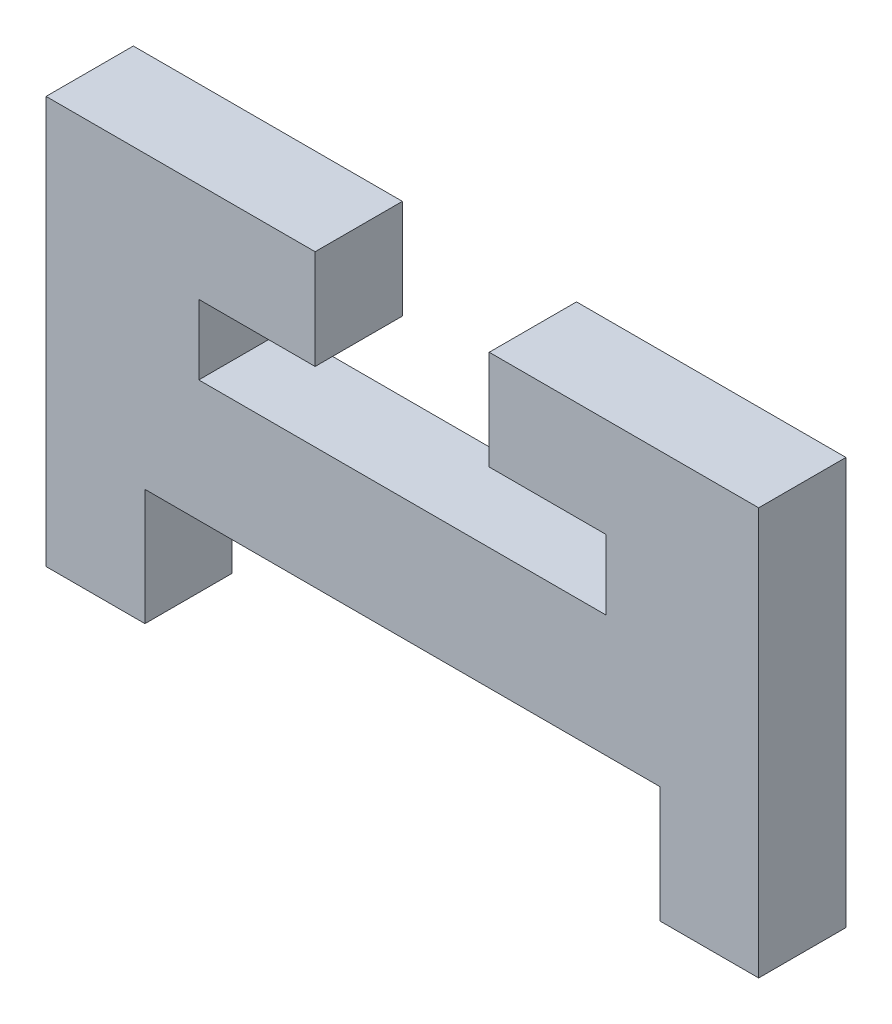
ISO-10303-21;
HEADER;
FILE_DESCRIPTION(('STEP AP214'),'2;1');
FILE_NAME('part.step','',(''),(''),'','','');
FILE_SCHEMA(('AUTOMOTIVE_DESIGN { 1 0 10303 214 1 1 1 1 }'));
ENDSEC;
DATA;
#1=APPLICATION_CONTEXT('core data for automotive mechanical design processes');
#2=APPLICATION_PROTOCOL_DEFINITION('international standard','automotive_design',2000,#1);
#3=PRODUCT_CONTEXT('',#1,'mechanical');
#4=PRODUCT('Part','Part','',(#3));
#5=PRODUCT_RELATED_PRODUCT_CATEGORY('part','',(#4));
#6=PRODUCT_DEFINITION_FORMATION('','',#4);
#7=PRODUCT_DEFINITION_CONTEXT('part definition',#1,'design');
#8=PRODUCT_DEFINITION('design','',#6,#7);
#9=PRODUCT_DEFINITION_SHAPE('','',#8);
#10=(LENGTH_UNIT() NAMED_UNIT(*) SI_UNIT(.MILLI.,.METRE.));
#11=(NAMED_UNIT(*) PLANE_ANGLE_UNIT() SI_UNIT($,.RADIAN.));
#12=(NAMED_UNIT(*) SI_UNIT($,.STERADIAN.) SOLID_ANGLE_UNIT());
#13=UNCERTAINTY_MEASURE_WITH_UNIT(LENGTH_MEASURE(1.E-05),#10,'distance_accuracy_value','');
#14=(GEOMETRIC_REPRESENTATION_CONTEXT(3) GLOBAL_UNCERTAINTY_ASSIGNED_CONTEXT((#13)) GLOBAL_UNIT_ASSIGNED_CONTEXT((#10,
#11,#12)) REPRESENTATION_CONTEXT('',''));
#15=CARTESIAN_POINT('',(0.,0.,0.));
#16=DIRECTION('',(0.,0.,1.));
#17=DIRECTION('',(1.,0.,0.));
#18=AXIS2_PLACEMENT_3D('',#15,#16,#17);
#19=CARTESIAN_POINT('',(38.05,11.7,3.));
#20=DIRECTION('',(1.,0.,0.));
#21=DIRECTION('',(0.,0.,-1.));
#22=AXIS2_PLACEMENT_3D('',#19,#20,#21);
#23=PLANE('',#22);
#24=DIRECTION('',(0.,-1.,0.));
#25=VECTOR('',#24,1.);
#26=CARTESIAN_POINT('',(38.05,11.7,0.));
#27=LINE('',#26,#25);
#28=CARTESIAN_POINT('',(38.05,11.7,0.));
#29=VERTEX_POINT('',#28);
#30=CARTESIAN_POINT('',(38.05,7.70000000000001,0.));
#31=VERTEX_POINT('',#30);
#32=EDGE_CURVE('E177',#29,#31,#27,.T.);
#33=ORIENTED_EDGE('',*,*,#32,.T.);
#34=DIRECTION('',(0.,0.,-1.));
#35=VECTOR('',#34,1.);
#36=CARTESIAN_POINT('',(38.05,7.70000000000001,3.));
#37=LINE('',#36,#35);
#38=CARTESIAN_POINT('',(38.05,7.70000000000001,3.));
#39=VERTEX_POINT('',#38);
#40=EDGE_CURVE('E11',#39,#31,#37,.T.);
#41=ORIENTED_EDGE('',*,*,#40,.F.);
#42=DIRECTION('',(0.,-1.,0.));
#43=VECTOR('',#42,1.);
#44=CARTESIAN_POINT('',(38.05,11.7,3.));
#45=LINE('',#44,#43);
#46=CARTESIAN_POINT('',(38.05,11.7,3.));
#47=VERTEX_POINT('',#46);
#48=EDGE_CURVE('E208',#47,#39,#45,.T.);
#49=ORIENTED_EDGE('',*,*,#48,.F.);
#50=DIRECTION('',(0.,0.,-1.));
#51=VECTOR('',#50,1.);
#52=CARTESIAN_POINT('',(38.05,11.7,3.));
#53=LINE('',#52,#51);
#54=EDGE_CURVE('E173',#47,#29,#53,.T.);
#55=ORIENTED_EDGE('',*,*,#54,.T.);
#56=EDGE_LOOP('',(#33,#41,#49,#55));
#57=FACE_BOUND('',#56,.T.);
#58=ADVANCED_FACE('F33',(#57),#23,.F.);
#59=CARTESIAN_POINT('',(38.05,7.70000000000001,3.));
#60=DIRECTION('',(0.,1.,0.));
#61=DIRECTION('',(0.,0.,1.));
#62=AXIS2_PLACEMENT_3D('',#59,#60,#61);
#63=PLANE('',#62);
#64=DIRECTION('',(1.,0.,0.));
#65=VECTOR('',#64,1.);
#66=CARTESIAN_POINT('',(38.05,7.70000000000001,0.));
#67=LINE('',#66,#65);
#68=CARTESIAN_POINT('',(41.45,7.70000000000001,0.));
#69=VERTEX_POINT('',#68);
#70=EDGE_CURVE('E180',#31,#69,#67,.T.);
#71=ORIENTED_EDGE('',*,*,#70,.T.);
#72=DIRECTION('',(0.,0.,-1.));
#73=VECTOR('',#72,1.);
#74=CARTESIAN_POINT('',(41.45,7.70000000000001,3.));
#75=LINE('',#74,#73);
#76=CARTESIAN_POINT('',(41.45,7.70000000000001,3.));
#77=VERTEX_POINT('',#76);
#78=EDGE_CURVE('E41',#77,#69,#75,.T.);
#79=ORIENTED_EDGE('',*,*,#78,.F.);
#80=DIRECTION('',(1.,0.,0.));
#81=VECTOR('',#80,1.);
#82=CARTESIAN_POINT('',(38.05,7.70000000000001,3.));
#83=LINE('',#82,#81);
#84=EDGE_CURVE('E116',#39,#77,#83,.T.);
#85=ORIENTED_EDGE('',*,*,#84,.F.);
#86=ORIENTED_EDGE('',*,*,#40,.T.);
#87=EDGE_LOOP('',(#71,#79,#85,#86));
#88=FACE_BOUND('',#87,.T.);
#89=ADVANCED_FACE('F306',(#88),#63,.F.);
#90=CARTESIAN_POINT('',(41.45,7.70000000000001,3.));
#91=DIRECTION('',(-1.,0.,0.));
#92=DIRECTION('',(0.,0.,1.));
#93=AXIS2_PLACEMENT_3D('',#90,#91,#92);
#94=PLANE('',#93);
#95=DIRECTION('',(0.,1.,0.));
#96=VECTOR('',#95,1.);
#97=CARTESIAN_POINT('',(41.45,7.70000000000001,0.));
#98=LINE('',#97,#96);
#99=CARTESIAN_POINT('',(41.45,21.7,0.));
#100=VERTEX_POINT('',#99);
#101=EDGE_CURVE('E182',#69,#100,#98,.T.);
#102=ORIENTED_EDGE('',*,*,#101,.T.);
#103=DIRECTION('',(0.,0.,-1.));
#104=VECTOR('',#103,1.);
#105=CARTESIAN_POINT('',(41.45,21.7,3.));
#106=LINE('',#105,#104);
#107=CARTESIAN_POINT('',(41.45,21.7,3.));
#108=VERTEX_POINT('',#107);
#109=EDGE_CURVE('E239',#108,#100,#106,.T.);
#110=ORIENTED_EDGE('',*,*,#109,.F.);
#111=DIRECTION('',(0.,1.,0.));
#112=VECTOR('',#111,1.);
#113=CARTESIAN_POINT('',(41.45,7.70000000000001,3.));
#114=LINE('',#113,#112);
#115=EDGE_CURVE('E247',#77,#108,#114,.T.);
#116=ORIENTED_EDGE('',*,*,#115,.F.);
#117=ORIENTED_EDGE('',*,*,#78,.T.);
#118=EDGE_LOOP('',(#102,#110,#116,#117));
#119=FACE_BOUND('',#118,.T.);
#120=ADVANCED_FACE('F245',(#119),#94,.F.);
#121=CARTESIAN_POINT('',(41.45,21.7,3.));
#122=DIRECTION('',(0.,-1.,0.));
#123=DIRECTION('',(0.,0.,-1.));
#124=AXIS2_PLACEMENT_3D('',#121,#122,#123);
#125=PLANE('',#124);
#126=DIRECTION('',(-1.,0.,0.));
#127=VECTOR('',#126,1.);
#128=CARTESIAN_POINT('',(41.45,21.7,0.));
#129=LINE('',#128,#127);
#130=CARTESIAN_POINT('',(32.1863854020223,21.7,0.));
#131=VERTEX_POINT('',#130);
#132=EDGE_CURVE('E184',#100,#131,#129,.T.);
#133=ORIENTED_EDGE('',*,*,#132,.T.);
#134=DIRECTION('',(0.,0.,-1.));
#135=VECTOR('',#134,1.);
#136=CARTESIAN_POINT('',(32.1863854020223,21.7,3.));
#137=LINE('',#136,#135);
#138=CARTESIAN_POINT('',(32.1863854020223,21.7,3.));
#139=VERTEX_POINT('',#138);
#140=EDGE_CURVE('E236',#139,#131,#137,.T.);
#141=ORIENTED_EDGE('',*,*,#140,.F.);
#142=DIRECTION('',(-1.,0.,0.));
#143=VECTOR('',#142,1.);
#144=CARTESIAN_POINT('',(41.45,21.7,3.));
#145=LINE('',#144,#143);
#146=EDGE_CURVE('E265',#108,#139,#145,.T.);
#147=ORIENTED_EDGE('',*,*,#146,.F.);
#148=ORIENTED_EDGE('',*,*,#109,.T.);
#149=EDGE_LOOP('',(#133,#141,#147,#148));
#150=FACE_BOUND('',#149,.T.);
#151=ADVANCED_FACE('F256',(#150),#125,.F.);
#152=CARTESIAN_POINT('',(32.1863854020223,21.7,3.));
#153=DIRECTION('',(1.,0.,0.));
#154=DIRECTION('',(0.,0.,-1.));
#155=AXIS2_PLACEMENT_3D('',#152,#153,#154);
#156=PLANE('',#155);
#157=DIRECTION('',(0.,-1.,0.));
#158=VECTOR('',#157,1.);
#159=CARTESIAN_POINT('',(32.1863854020223,21.7,0.));
#160=LINE('',#159,#158);
#161=CARTESIAN_POINT('',(32.1863854020223,18.2826832944775,0.));
#162=VERTEX_POINT('',#161);
#163=EDGE_CURVE('E186',#131,#162,#160,.T.);
#164=ORIENTED_EDGE('',*,*,#163,.T.);
#165=DIRECTION('',(0.,0.,-1.));
#166=VECTOR('',#165,1.);
#167=CARTESIAN_POINT('',(32.1863854020223,18.2826832944775,3.));
#168=LINE('',#167,#166);
#169=CARTESIAN_POINT('',(32.1863854020223,18.2826832944775,3.));
#170=VERTEX_POINT('',#169);
#171=EDGE_CURVE('E233',#170,#162,#168,.T.);
#172=ORIENTED_EDGE('',*,*,#171,.F.);
#173=DIRECTION('',(0.,-1.,0.));
#174=VECTOR('',#173,1.);
#175=CARTESIAN_POINT('',(32.1863854020223,21.7,3.));
#176=LINE('',#175,#174);
#177=EDGE_CURVE('E262',#139,#170,#176,.T.);
#178=ORIENTED_EDGE('',*,*,#177,.F.);
#179=ORIENTED_EDGE('',*,*,#140,.T.);
#180=EDGE_LOOP('',(#164,#172,#178,#179));
#181=FACE_BOUND('',#180,.T.);
#182=ADVANCED_FACE('F260',(#181),#156,.F.);
#183=CARTESIAN_POINT('',(32.1863854020223,18.2826832944775,3.));
#184=DIRECTION('',(0.,1.,0.));
#185=DIRECTION('',(0.,0.,1.));
#186=AXIS2_PLACEMENT_3D('',#183,#184,#185);
#187=PLANE('',#186);
#188=DIRECTION('',(1.,0.,0.));
#189=VECTOR('',#188,1.);
#190=CARTESIAN_POINT('',(32.1863854020223,18.2826832944775,0.));
#191=LINE('',#190,#189);
#192=CARTESIAN_POINT('',(36.2,18.2826832944775,0.));
#193=VERTEX_POINT('',#192);
#194=EDGE_CURVE('E188',#162,#193,#191,.T.);
#195=ORIENTED_EDGE('',*,*,#194,.T.);
#196=DIRECTION('',(0.,0.,-1.));
#197=VECTOR('',#196,1.);
#198=CARTESIAN_POINT('',(36.2,18.2826832944775,3.));
#199=LINE('',#198,#197);
#200=CARTESIAN_POINT('',(36.2,18.2826832944775,3.));
#201=VERTEX_POINT('',#200);
#202=EDGE_CURVE('E230',#201,#193,#199,.T.);
#203=ORIENTED_EDGE('',*,*,#202,.F.);
#204=DIRECTION('',(1.,0.,0.));
#205=VECTOR('',#204,1.);
#206=CARTESIAN_POINT('',(32.1863854020223,18.2826832944775,3.));
#207=LINE('',#206,#205);
#208=EDGE_CURVE('E264',#170,#201,#207,.T.);
#209=ORIENTED_EDGE('',*,*,#208,.F.);
#210=ORIENTED_EDGE('',*,*,#171,.T.);
#211=EDGE_LOOP('',(#195,#203,#209,#210));
#212=FACE_BOUND('',#211,.T.);
#213=ADVANCED_FACE('F319',(#212),#187,.F.);
#214=CARTESIAN_POINT('',(36.2,18.2826832944775,3.));
#215=DIRECTION('',(1.,0.,0.));
#216=DIRECTION('',(0.,0.,-1.));
#217=AXIS2_PLACEMENT_3D('',#214,#215,#216);
#218=PLANE('',#217);
#219=DIRECTION('',(0.,-1.,0.));
#220=VECTOR('',#219,1.);
#221=CARTESIAN_POINT('',(36.2,18.2826832944775,0.));
#222=LINE('',#221,#220);
#223=CARTESIAN_POINT('',(36.2,15.8826832944775,0.));
#224=VERTEX_POINT('',#223);
#225=EDGE_CURVE('E190',#193,#224,#222,.T.);
#226=ORIENTED_EDGE('',*,*,#225,.T.);
#227=DIRECTION('',(0.,0.,-1.));
#228=VECTOR('',#227,1.);
#229=CARTESIAN_POINT('',(36.2,15.8826832944775,3.));
#230=LINE('',#229,#228);
#231=CARTESIAN_POINT('',(36.2,15.8826832944775,3.));
#232=VERTEX_POINT('',#231);
#233=EDGE_CURVE('E227',#232,#224,#230,.T.);
#234=ORIENTED_EDGE('',*,*,#233,.F.);
#235=DIRECTION('',(0.,-1.,0.));
#236=VECTOR('',#235,1.);
#237=CARTESIAN_POINT('',(36.2,18.2826832944775,3.));
#238=LINE('',#237,#236);
#239=EDGE_CURVE('E267',#201,#232,#238,.T.);
#240=ORIENTED_EDGE('',*,*,#239,.F.);
#241=ORIENTED_EDGE('',*,*,#202,.T.);
#242=EDGE_LOOP('',(#226,#234,#240,#241));
#243=FACE_BOUND('',#242,.T.);
#244=ADVANCED_FACE('F322',(#243),#218,.F.);
#245=CARTESIAN_POINT('',(29.7,15.8826832944775,3.));
#246=DIRECTION('',(0.,-1.,0.));
#247=DIRECTION('',(0.,0.,-1.));
#248=AXIS2_PLACEMENT_3D('',#245,#246,#247);
#249=PLANE('',#248);
#250=DIRECTION('',(-1.,0.,0.));
#251=VECTOR('',#250,1.);
#252=CARTESIAN_POINT('',(29.7,15.8826832944775,0.));
#253=LINE('',#252,#251);
#254=CARTESIAN_POINT('',(22.2,15.8826832944775,0.));
#255=VERTEX_POINT('',#254);
#256=EDGE_CURVE('E193',#224,#255,#253,.T.);
#257=ORIENTED_EDGE('',*,*,#256,.T.);
#258=DIRECTION('',(0.,0.,-1.));
#259=VECTOR('',#258,1.);
#260=CARTESIAN_POINT('',(22.2,15.8826832944775,3.));
#261=LINE('',#260,#259);
#262=CARTESIAN_POINT('',(22.2,15.8826832944775,3.));
#263=VERTEX_POINT('',#262);
#264=EDGE_CURVE('E224',#263,#255,#261,.T.);
#265=ORIENTED_EDGE('',*,*,#264,.F.);
#266=DIRECTION('',(-1.,0.,0.));
#267=VECTOR('',#266,1.);
#268=CARTESIAN_POINT('',(36.2,15.8826832944775,3.));
#269=LINE('',#268,#267);
#270=EDGE_CURVE('E273',#232,#263,#269,.T.);
#271=ORIENTED_EDGE('',*,*,#270,.F.);
#272=ORIENTED_EDGE('',*,*,#233,.T.);
#273=EDGE_LOOP('',(#257,#265,#271,#272));
#274=FACE_BOUND('',#273,.T.);
#275=ADVANCED_FACE('F326',(#274),#249,.F.);
#276=CARTESIAN_POINT('',(22.2,15.8826832944775,3.));
#277=DIRECTION('',(-1.,0.,0.));
#278=DIRECTION('',(0.,0.,1.));
#279=AXIS2_PLACEMENT_3D('',#276,#277,#278);
#280=PLANE('',#279);
#281=DIRECTION('',(0.,1.,0.));
#282=VECTOR('',#281,1.);
#283=CARTESIAN_POINT('',(22.2,15.8826832944775,0.));
#284=LINE('',#283,#282);
#285=CARTESIAN_POINT('',(22.2,18.2826832944775,0.));
#286=VERTEX_POINT('',#285);
#287=EDGE_CURVE('E195',#255,#286,#284,.T.);
#288=ORIENTED_EDGE('',*,*,#287,.T.);
#289=DIRECTION('',(0.,0.,-1.));
#290=VECTOR('',#289,1.);
#291=CARTESIAN_POINT('',(22.2,18.2826832944775,3.));
#292=LINE('',#291,#290);
#293=CARTESIAN_POINT('',(22.2,18.2826832944775,3.));
#294=VERTEX_POINT('',#293);
#295=EDGE_CURVE('E221',#294,#286,#292,.T.);
#296=ORIENTED_EDGE('',*,*,#295,.F.);
#297=DIRECTION('',(0.,1.,0.));
#298=VECTOR('',#297,1.);
#299=CARTESIAN_POINT('',(22.2,15.8826832944775,3.));
#300=LINE('',#299,#298);
#301=EDGE_CURVE('E275',#263,#294,#300,.T.);
#302=ORIENTED_EDGE('',*,*,#301,.F.);
#303=ORIENTED_EDGE('',*,*,#264,.T.);
#304=EDGE_LOOP('',(#288,#296,#302,#303));
#305=FACE_BOUND('',#304,.T.);
#306=ADVANCED_FACE('F330',(#305),#280,.F.);
#307=CARTESIAN_POINT('',(22.2,18.2826832944775,3.));
#308=DIRECTION('',(0.,1.,0.));
#309=DIRECTION('',(0.,0.,1.));
#310=AXIS2_PLACEMENT_3D('',#307,#308,#309);
#311=PLANE('',#310);
#312=DIRECTION('',(1.,0.,0.));
#313=VECTOR('',#312,1.);
#314=CARTESIAN_POINT('',(22.2,18.2826832944775,0.));
#315=LINE('',#314,#313);
#316=CARTESIAN_POINT('',(26.2,18.2826832944775,0.));
#317=VERTEX_POINT('',#316);
#318=EDGE_CURVE('E197',#286,#317,#315,.T.);
#319=ORIENTED_EDGE('',*,*,#318,.T.);
#320=DIRECTION('',(0.,0.,-1.));
#321=VECTOR('',#320,1.);
#322=CARTESIAN_POINT('',(26.2,18.2826832944775,3.));
#323=LINE('',#322,#321);
#324=CARTESIAN_POINT('',(26.2,18.2826832944775,3.));
#325=VERTEX_POINT('',#324);
#326=EDGE_CURVE('E218',#325,#317,#323,.T.);
#327=ORIENTED_EDGE('',*,*,#326,.F.);
#328=DIRECTION('',(1.,0.,0.));
#329=VECTOR('',#328,1.);
#330=CARTESIAN_POINT('',(22.2,18.2826832944775,3.));
#331=LINE('',#330,#329);
#332=EDGE_CURVE('E277',#294,#325,#331,.T.);
#333=ORIENTED_EDGE('',*,*,#332,.F.);
#334=ORIENTED_EDGE('',*,*,#295,.T.);
#335=EDGE_LOOP('',(#319,#327,#333,#334));
#336=FACE_BOUND('',#335,.T.);
#337=ADVANCED_FACE('F334',(#336),#311,.F.);
#338=CARTESIAN_POINT('',(26.2,18.2826832944775,3.));
#339=DIRECTION('',(-1.,0.,0.));
#340=DIRECTION('',(0.,0.,1.));
#341=AXIS2_PLACEMENT_3D('',#338,#339,#340);
#342=PLANE('',#341);
#343=DIRECTION('',(0.,1.,0.));
#344=VECTOR('',#343,1.);
#345=CARTESIAN_POINT('',(26.2,18.2826832944775,0.));
#346=LINE('',#345,#344);
#347=CARTESIAN_POINT('',(26.2,21.7,0.));
#348=VERTEX_POINT('',#347);
#349=EDGE_CURVE('E199',#317,#348,#346,.T.);
#350=ORIENTED_EDGE('',*,*,#349,.T.);
#351=DIRECTION('',(0.,0.,-1.));
#352=VECTOR('',#351,1.);
#353=CARTESIAN_POINT('',(26.2,21.7,3.));
#354=LINE('',#353,#352);
#355=CARTESIAN_POINT('',(26.2,21.7,3.));
#356=VERTEX_POINT('',#355);
#357=EDGE_CURVE('E215',#356,#348,#354,.T.);
#358=ORIENTED_EDGE('',*,*,#357,.F.);
#359=DIRECTION('',(0.,1.,0.));
#360=VECTOR('',#359,1.);
#361=CARTESIAN_POINT('',(26.2,18.2826832944775,3.));
#362=LINE('',#361,#360);
#363=EDGE_CURVE('E279',#325,#356,#362,.T.);
#364=ORIENTED_EDGE('',*,*,#363,.F.);
#365=ORIENTED_EDGE('',*,*,#326,.T.);
#366=EDGE_LOOP('',(#350,#358,#364,#365));
#367=FACE_BOUND('',#366,.T.);
#368=ADVANCED_FACE('F338',(#367),#342,.F.);
#369=CARTESIAN_POINT('',(26.2,21.7,3.));
#370=DIRECTION('',(0.,-1.,0.));
#371=DIRECTION('',(0.,0.,-1.));
#372=AXIS2_PLACEMENT_3D('',#369,#370,#371);
#373=PLANE('',#372);
#374=DIRECTION('',(-1.,0.,0.));
#375=VECTOR('',#374,1.);
#376=CARTESIAN_POINT('',(26.2,21.7,0.));
#377=LINE('',#376,#375);
#378=CARTESIAN_POINT('',(16.95,21.7,0.));
#379=VERTEX_POINT('',#378);
#380=EDGE_CURVE('E201',#348,#379,#377,.T.);
#381=ORIENTED_EDGE('',*,*,#380,.T.);
#382=DIRECTION('',(0.,0.,-1.));
#383=VECTOR('',#382,1.);
#384=CARTESIAN_POINT('',(16.95,21.7,3.));
#385=LINE('',#384,#383);
#386=CARTESIAN_POINT('',(16.95,21.7,3.));
#387=VERTEX_POINT('',#386);
#388=EDGE_CURVE('E212',#387,#379,#385,.T.);
#389=ORIENTED_EDGE('',*,*,#388,.F.);
#390=DIRECTION('',(-1.,0.,0.));
#391=VECTOR('',#390,1.);
#392=CARTESIAN_POINT('',(26.2,21.7,3.));
#393=LINE('',#392,#391);
#394=EDGE_CURVE('E281',#356,#387,#393,.T.);
#395=ORIENTED_EDGE('',*,*,#394,.F.);
#396=ORIENTED_EDGE('',*,*,#357,.T.);
#397=EDGE_LOOP('',(#381,#389,#395,#396));
#398=FACE_BOUND('',#397,.T.);
#399=ADVANCED_FACE('F287',(#398),#373,.F.);
#400=CARTESIAN_POINT('',(16.95,21.7,3.));
#401=DIRECTION('',(1.,0.,0.));
#402=DIRECTION('',(0.,0.,-1.));
#403=AXIS2_PLACEMENT_3D('',#400,#401,#402);
#404=PLANE('',#403);
#405=DIRECTION('',(0.,-1.,0.));
#406=VECTOR('',#405,1.);
#407=CARTESIAN_POINT('',(16.95,21.7,0.));
#408=LINE('',#407,#406);
#409=CARTESIAN_POINT('',(16.95,7.70000000000001,0.));
#410=VERTEX_POINT('',#409);
#411=EDGE_CURVE('E203',#379,#410,#408,.T.);
#412=ORIENTED_EDGE('',*,*,#411,.T.);
#413=DIRECTION('',(0.,0.,-1.));
#414=VECTOR('',#413,1.);
#415=CARTESIAN_POINT('',(16.95,7.70000000000001,3.));
#416=LINE('',#415,#414);
#417=CARTESIAN_POINT('',(16.95,7.70000000000001,3.));
#418=VERTEX_POINT('',#417);
#419=EDGE_CURVE('E168',#418,#410,#416,.T.);
#420=ORIENTED_EDGE('',*,*,#419,.F.);
#421=DIRECTION('',(0.,-1.,0.));
#422=VECTOR('',#421,1.);
#423=CARTESIAN_POINT('',(16.95,21.7,3.));
#424=LINE('',#423,#422);
#425=EDGE_CURVE('E159',#387,#418,#424,.T.);
#426=ORIENTED_EDGE('',*,*,#425,.F.);
#427=ORIENTED_EDGE('',*,*,#388,.T.);
#428=EDGE_LOOP('',(#412,#420,#426,#427));
#429=FACE_BOUND('',#428,.T.);
#430=ADVANCED_FACE('F291',(#429),#404,.F.);
#431=CARTESIAN_POINT('',(16.95,7.70000000000001,3.));
#432=DIRECTION('',(0.,1.,0.));
#433=DIRECTION('',(0.,0.,1.));
#434=AXIS2_PLACEMENT_3D('',#431,#432,#433);
#435=PLANE('',#434);
#436=DIRECTION('',(1.,0.,0.));
#437=VECTOR('',#436,1.);
#438=CARTESIAN_POINT('',(16.95,7.70000000000001,0.));
#439=LINE('',#438,#437);
#440=CARTESIAN_POINT('',(20.35,7.70000000000001,0.));
#441=VERTEX_POINT('',#440);
#442=EDGE_CURVE('E167',#410,#441,#439,.T.);
#443=ORIENTED_EDGE('',*,*,#442,.T.);
#444=DIRECTION('',(0.,0.,-1.));
#445=VECTOR('',#444,1.);
#446=CARTESIAN_POINT('',(20.35,7.70000000000001,3.));
#447=LINE('',#446,#445);
#448=CARTESIAN_POINT('',(20.35,7.70000000000001,3.));
#449=VERTEX_POINT('',#448);
#450=EDGE_CURVE('E164',#449,#441,#447,.T.);
#451=ORIENTED_EDGE('',*,*,#450,.F.);
#452=DIRECTION('',(1.,0.,0.));
#453=VECTOR('',#452,1.);
#454=CARTESIAN_POINT('',(16.95,7.70000000000001,3.));
#455=LINE('',#454,#453);
#456=EDGE_CURVE('E153',#418,#449,#455,.T.);
#457=ORIENTED_EDGE('',*,*,#456,.F.);
#458=ORIENTED_EDGE('',*,*,#419,.T.);
#459=EDGE_LOOP('',(#443,#451,#457,#458));
#460=FACE_BOUND('',#459,.T.);
#461=ADVANCED_FACE('F165',(#460),#435,.F.);
#462=CARTESIAN_POINT('',(20.35,7.70000000000001,3.));
#463=DIRECTION('',(-1.,0.,0.));
#464=DIRECTION('',(0.,0.,1.));
#465=AXIS2_PLACEMENT_3D('',#462,#463,#464);
#466=PLANE('',#465);
#467=DIRECTION('',(0.,1.,0.));
#468=VECTOR('',#467,1.);
#469=CARTESIAN_POINT('',(20.35,7.70000000000001,0.));
#470=LINE('',#469,#468);
#471=CARTESIAN_POINT('',(20.35,11.7,0.));
#472=VERTEX_POINT('',#471);
#473=EDGE_CURVE('E102',#441,#472,#470,.T.);
#474=ORIENTED_EDGE('',*,*,#473,.T.);
#475=DIRECTION('',(0.,0.,-1.));
#476=VECTOR('',#475,1.);
#477=CARTESIAN_POINT('',(20.35,11.7,3.));
#478=LINE('',#477,#476);
#479=CARTESIAN_POINT('',(20.35,11.7,3.));
#480=VERTEX_POINT('',#479);
#481=EDGE_CURVE('E169',#480,#472,#478,.T.);
#482=ORIENTED_EDGE('',*,*,#481,.F.);
#483=DIRECTION('',(0.,1.,0.));
#484=VECTOR('',#483,1.);
#485=CARTESIAN_POINT('',(20.35,7.70000000000001,3.));
#486=LINE('',#485,#484);
#487=EDGE_CURVE('E157',#449,#480,#486,.T.);
#488=ORIENTED_EDGE('',*,*,#487,.F.);
#489=ORIENTED_EDGE('',*,*,#450,.T.);
#490=EDGE_LOOP('',(#474,#482,#488,#489));
#491=FACE_BOUND('',#490,.T.);
#492=ADVANCED_FACE('F171',(#491),#466,.F.);
#493=CARTESIAN_POINT('',(20.35,11.7,3.));
#494=DIRECTION('',(0.,1.,0.));
#495=DIRECTION('',(0.,0.,1.));
#496=AXIS2_PLACEMENT_3D('',#493,#494,#495);
#497=PLANE('',#496);
#498=DIRECTION('',(1.,0.,0.));
#499=VECTOR('',#498,1.);
#500=CARTESIAN_POINT('',(20.35,11.7,0.));
#501=LINE('',#500,#499);
#502=EDGE_CURVE('E108',#472,#29,#501,.T.);
#503=ORIENTED_EDGE('',*,*,#502,.T.);
#504=ORIENTED_EDGE('',*,*,#54,.F.);
#505=DIRECTION('',(1.,0.,0.));
#506=VECTOR('',#505,1.);
#507=CARTESIAN_POINT('',(20.35,11.7,3.));
#508=LINE('',#507,#506);
#509=EDGE_CURVE('E49',#480,#47,#508,.T.);
#510=ORIENTED_EDGE('',*,*,#509,.F.);
#511=ORIENTED_EDGE('',*,*,#481,.T.);
#512=EDGE_LOOP('',(#503,#504,#510,#511));
#513=FACE_BOUND('',#512,.T.);
#514=ADVANCED_FACE('F295',(#513),#497,.F.);
#515=CARTESIAN_POINT('',(0.,0.,3.));
#516=DIRECTION('',(0.,0.,1.));
#517=DIRECTION('',(1.,0.,0.));
#518=AXIS2_PLACEMENT_3D('',#515,#516,#517);
#519=PLANE('',#518);
#520=ORIENTED_EDGE('',*,*,#48,.T.);
#521=ORIENTED_EDGE('',*,*,#84,.T.);
#522=ORIENTED_EDGE('',*,*,#115,.T.);
#523=ORIENTED_EDGE('',*,*,#146,.T.);
#524=ORIENTED_EDGE('',*,*,#177,.T.);
#525=ORIENTED_EDGE('',*,*,#208,.T.);
#526=ORIENTED_EDGE('',*,*,#239,.T.);
#527=ORIENTED_EDGE('',*,*,#270,.T.);
#528=ORIENTED_EDGE('',*,*,#301,.T.);
#529=ORIENTED_EDGE('',*,*,#332,.T.);
#530=ORIENTED_EDGE('',*,*,#363,.T.);
#531=ORIENTED_EDGE('',*,*,#394,.T.);
#532=ORIENTED_EDGE('',*,*,#425,.T.);
#533=ORIENTED_EDGE('',*,*,#456,.T.);
#534=ORIENTED_EDGE('',*,*,#487,.T.);
#535=ORIENTED_EDGE('',*,*,#509,.T.);
#536=EDGE_LOOP('',(#520,#521,#522,#523,#524,#525,#526,#527,#528,#529,#530,#531,#532,#533,#534,#535));
#537=FACE_BOUND('',#536,.T.);
#538=ADVANCED_FACE('F155',(#537),#519,.T.);
#539=CARTESIAN_POINT('',(0.,0.,0.));
#540=DIRECTION('',(0.,0.,1.));
#541=DIRECTION('',(1.,0.,0.));
#542=AXIS2_PLACEMENT_3D('',#539,#540,#541);
#543=PLANE('',#542);
#544=ORIENTED_EDGE('',*,*,#32,.F.);
#545=ORIENTED_EDGE('',*,*,#502,.F.);
#546=ORIENTED_EDGE('',*,*,#473,.F.);
#547=ORIENTED_EDGE('',*,*,#442,.F.);
#548=ORIENTED_EDGE('',*,*,#411,.F.);
#549=ORIENTED_EDGE('',*,*,#380,.F.);
#550=ORIENTED_EDGE('',*,*,#349,.F.);
#551=ORIENTED_EDGE('',*,*,#318,.F.);
#552=ORIENTED_EDGE('',*,*,#287,.F.);
#553=ORIENTED_EDGE('',*,*,#256,.F.);
#554=ORIENTED_EDGE('',*,*,#225,.F.);
#555=ORIENTED_EDGE('',*,*,#194,.F.);
#556=ORIENTED_EDGE('',*,*,#163,.F.);
#557=ORIENTED_EDGE('',*,*,#132,.F.);
#558=ORIENTED_EDGE('',*,*,#101,.F.);
#559=ORIENTED_EDGE('',*,*,#70,.F.);
#560=EDGE_LOOP('',(#544,#545,#546,#547,#548,#549,#550,#551,#552,#553,#554,#555,#556,#557,#558,#559));
#561=FACE_BOUND('',#560,.T.);
#562=ADVANCED_FACE('F251',(#561),#543,.F.);
#563=CLOSED_SHELL('',(#58,#89,#120,#151,#182,#213,#244,#275,#306,#337,#368,#399,#430,#461,#492,
#514,#538,#562));
#564=MANIFOLD_SOLID_BREP('B2',#563);
#565=ADVANCED_BREP_SHAPE_REPRESENTATION('',(#18,#564),#14);
#566=SHAPE_DEFINITION_REPRESENTATION(#9,#565);
ENDSEC;
END-ISO-10303-21;
